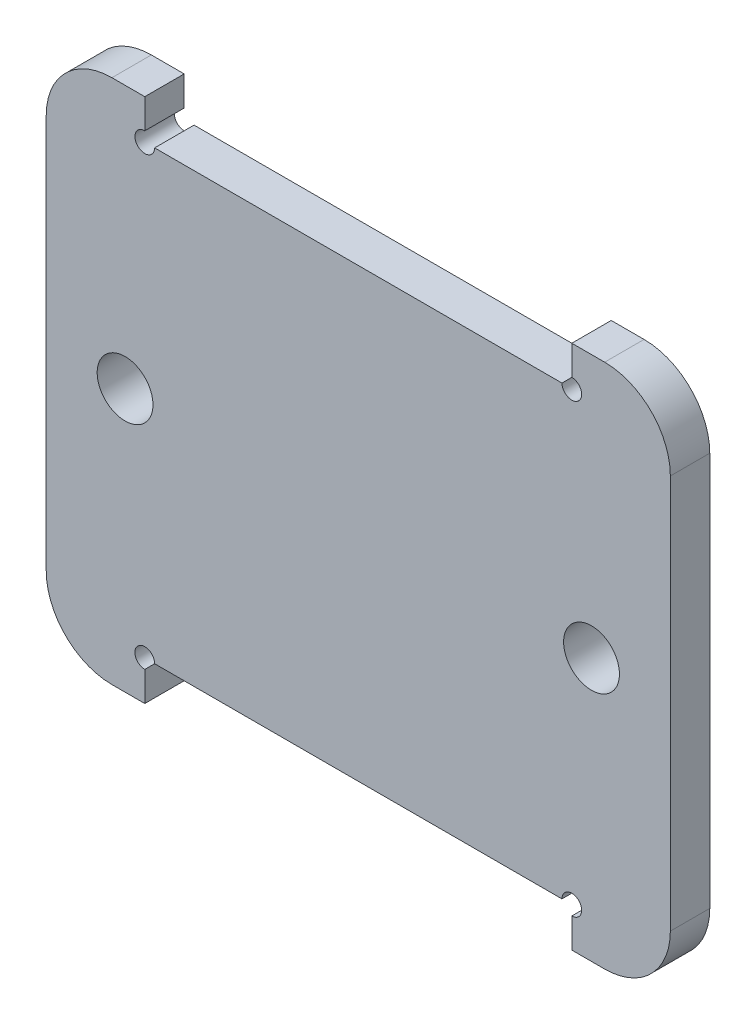
ISO-10303-21;
HEADER;
FILE_DESCRIPTION(('STEP AP214'),'2;1');
FILE_NAME('part.step','',(''),(''),'','','');
FILE_SCHEMA(('AUTOMOTIVE_DESIGN { 1 0 10303 214 1 1 1 1 }'));
ENDSEC;
DATA;
#1=APPLICATION_CONTEXT('core data for automotive mechanical design processes');
#2=APPLICATION_PROTOCOL_DEFINITION('international standard','automotive_design',2000,#1);
#3=PRODUCT_CONTEXT('',#1,'mechanical');
#4=PRODUCT('Part','Part','',(#3));
#5=PRODUCT_RELATED_PRODUCT_CATEGORY('part','',(#4));
#6=PRODUCT_DEFINITION_FORMATION('','',#4);
#7=PRODUCT_DEFINITION_CONTEXT('part definition',#1,'design');
#8=PRODUCT_DEFINITION('design','',#6,#7);
#9=PRODUCT_DEFINITION_SHAPE('','',#8);
#10=(LENGTH_UNIT() NAMED_UNIT(*) SI_UNIT(.MILLI.,.METRE.));
#11=(NAMED_UNIT(*) PLANE_ANGLE_UNIT() SI_UNIT($,.RADIAN.));
#12=(NAMED_UNIT(*) SI_UNIT($,.STERADIAN.) SOLID_ANGLE_UNIT());
#13=UNCERTAINTY_MEASURE_WITH_UNIT(LENGTH_MEASURE(1.E-05),#10,'distance_accuracy_value','');
#14=(GEOMETRIC_REPRESENTATION_CONTEXT(3) GLOBAL_UNCERTAINTY_ASSIGNED_CONTEXT((#13)) GLOBAL_UNIT_ASSIGNED_CONTEXT((#10,
#11,#12)) REPRESENTATION_CONTEXT('',''));
#15=CARTESIAN_POINT('',(0.,0.,0.));
#16=DIRECTION('',(0.,0.,1.));
#17=DIRECTION('',(1.,0.,0.));
#18=AXIS2_PLACEMENT_3D('',#15,#16,#17);
#19=CARTESIAN_POINT('',(-310.,90.0000000000003,6.));
#20=DIRECTION('',(0.,0.,-1.));
#21=DIRECTION('',(-1.,0.,0.));
#22=AXIS2_PLACEMENT_3D('',#19,#20,#21);
#23=PLANE('',#22);
#24=DIRECTION('',(1.,0.,0.));
#25=VECTOR('',#24,1.);
#26=CARTESIAN_POINT('',(-315.,26.0000000000003,6.));
#27=LINE('',#26,#25);
#28=CARTESIAN_POINT('',(-378.5,26.0000000000003,6.));
#29=VERTEX_POINT('',#28);
#30=CARTESIAN_POINT('',(-316.5,26.0000000000003,6.));
#31=VERTEX_POINT('',#30);
#32=EDGE_CURVE('E186',#29,#31,#27,.T.);
#33=ORIENTED_EDGE('',*,*,#32,.T.);
#34=CARTESIAN_POINT('',(-315.,26.0000000000003,6.));
#35=DIRECTION('',(0.,0.,1.));
#36=DIRECTION('',(-1.,0.,0.));
#37=AXIS2_PLACEMENT_3D('',#34,#35,#36);
#38=CIRCLE('',#37,1.50000000000002);
#39=CARTESIAN_POINT('',(-315.,24.5000000000003,6.));
#40=VERTEX_POINT('',#39);
#41=EDGE_CURVE('E169',#40,#31,#38,.T.);
#42=ORIENTED_EDGE('',*,*,#41,.F.);
#43=DIRECTION('',(0.,-1.,0.));
#44=VECTOR('',#43,1.);
#45=CARTESIAN_POINT('',(-315.,20.0000000000003,6.));
#46=LINE('',#45,#44);
#47=CARTESIAN_POINT('',(-315.,20.0000000000003,6.));
#48=VERTEX_POINT('',#47);
#49=EDGE_CURVE('E196',#40,#48,#46,.T.);
#50=ORIENTED_EDGE('',*,*,#49,.T.);
#51=DIRECTION('',(1.,0.,0.));
#52=VECTOR('',#51,1.);
#53=CARTESIAN_POINT('',(-310.,20.0000000000003,6.));
#54=LINE('',#53,#52);
#55=CARTESIAN_POINT('',(-310.,20.0000000000003,6.));
#56=VERTEX_POINT('',#55);
#57=EDGE_CURVE('E199',#48,#56,#54,.T.);
#58=ORIENTED_EDGE('',*,*,#57,.T.);
#59=CARTESIAN_POINT('',(-310.,30.0000000000002,6.));
#60=DIRECTION('',(0.,0.,1.));
#61=DIRECTION('',(-1.,0.,0.));
#62=AXIS2_PLACEMENT_3D('',#59,#60,#61);
#63=CIRCLE('',#62,10.);
#64=CARTESIAN_POINT('',(-300.,30.0000000000003,6.));
#65=VERTEX_POINT('',#64);
#66=EDGE_CURVE('E206',#56,#65,#63,.T.);
#67=ORIENTED_EDGE('',*,*,#66,.T.);
#68=DIRECTION('',(0.,1.,0.));
#69=VECTOR('',#68,1.);
#70=CARTESIAN_POINT('',(-300.,90.0000000000003,6.));
#71=LINE('',#70,#69);
#72=CARTESIAN_POINT('',(-300.,90.0000000000003,6.));
#73=VERTEX_POINT('',#72);
#74=EDGE_CURVE('E208',#65,#73,#71,.T.);
#75=ORIENTED_EDGE('',*,*,#74,.T.);
#76=CARTESIAN_POINT('',(-310.,90.0000000000003,6.));
#77=DIRECTION('',(0.,0.,1.));
#78=DIRECTION('',(-1.,0.,0.));
#79=AXIS2_PLACEMENT_3D('',#76,#77,#78);
#80=CIRCLE('',#79,10.);
#81=CARTESIAN_POINT('',(-310.,100.,6.));
#82=VERTEX_POINT('',#81);
#83=EDGE_CURVE('E210',#73,#82,#80,.T.);
#84=ORIENTED_EDGE('',*,*,#83,.T.);
#85=DIRECTION('',(-1.,0.,0.));
#86=VECTOR('',#85,1.);
#87=CARTESIAN_POINT('',(-315.,100.,6.));
#88=LINE('',#87,#86);
#89=CARTESIAN_POINT('',(-315.,100.,6.));
#90=VERTEX_POINT('',#89);
#91=EDGE_CURVE('E212',#82,#90,#88,.T.);
#92=ORIENTED_EDGE('',*,*,#91,.T.);
#93=DIRECTION('',(0.,-1.,0.));
#94=VECTOR('',#93,1.);
#95=CARTESIAN_POINT('',(-315.,94.0000000000003,6.));
#96=LINE('',#95,#94);
#97=CARTESIAN_POINT('',(-315.,95.5000000000003,6.));
#98=VERTEX_POINT('',#97);
#99=EDGE_CURVE('E250',#90,#98,#96,.T.);
#100=ORIENTED_EDGE('',*,*,#99,.T.);
#101=CARTESIAN_POINT('',(-315.,94.0000000000003,6.));
#102=DIRECTION('',(0.,0.,1.));
#103=DIRECTION('',(1.,0.,0.));
#104=AXIS2_PLACEMENT_3D('',#101,#102,#103);
#105=CIRCLE('',#104,1.50000000000002);
#106=CARTESIAN_POINT('',(-316.5,94.0000000000003,6.));
#107=VERTEX_POINT('',#106);
#108=EDGE_CURVE('E363',#107,#98,#105,.T.);
#109=ORIENTED_EDGE('',*,*,#108,.F.);
#110=DIRECTION('',(-1.,0.,0.));
#111=VECTOR('',#110,1.);
#112=CARTESIAN_POINT('',(-380.,94.0000000000003,6.));
#113=LINE('',#112,#111);
#114=CARTESIAN_POINT('',(-378.5,94.0000000000003,6.));
#115=VERTEX_POINT('',#114);
#116=EDGE_CURVE('E356',#107,#115,#113,.T.);
#117=ORIENTED_EDGE('',*,*,#116,.T.);
#118=CARTESIAN_POINT('',(-380.,94.0000000000003,6.));
#119=DIRECTION('',(0.,0.,1.));
#120=DIRECTION('',(-1.,0.,0.));
#121=AXIS2_PLACEMENT_3D('',#118,#119,#120);
#122=CIRCLE('',#121,1.50000000000002);
#123=CARTESIAN_POINT('',(-380.,95.5000000000003,6.));
#124=VERTEX_POINT('',#123);
#125=EDGE_CURVE('E358',#124,#115,#122,.T.);
#126=ORIENTED_EDGE('',*,*,#125,.F.);
#127=DIRECTION('',(0.,1.,0.));
#128=VECTOR('',#127,1.);
#129=CARTESIAN_POINT('',(-380.,94.0000000000003,6.));
#130=LINE('',#129,#128);
#131=CARTESIAN_POINT('',(-380.,100.,6.));
#132=VERTEX_POINT('',#131);
#133=EDGE_CURVE('E293',#124,#132,#130,.T.);
#134=ORIENTED_EDGE('',*,*,#133,.T.);
#135=DIRECTION('',(-1.,0.,0.));
#136=VECTOR('',#135,1.);
#137=CARTESIAN_POINT('',(-380.,100.,6.));
#138=LINE('',#137,#136);
#139=CARTESIAN_POINT('',(-385.,100.,6.));
#140=VERTEX_POINT('',#139);
#141=EDGE_CURVE('E313',#132,#140,#138,.T.);
#142=ORIENTED_EDGE('',*,*,#141,.T.);
#143=CARTESIAN_POINT('',(-385.,90.0000000000003,6.));
#144=DIRECTION('',(0.,0.,1.));
#145=DIRECTION('',(1.,0.,0.));
#146=AXIS2_PLACEMENT_3D('',#143,#144,#145);
#147=CIRCLE('',#146,10.);
#148=CARTESIAN_POINT('',(-395.,90.0000000000003,6.));
#149=VERTEX_POINT('',#148);
#150=EDGE_CURVE('E310',#140,#149,#147,.T.);
#151=ORIENTED_EDGE('',*,*,#150,.T.);
#152=DIRECTION('',(0.,-1.,0.));
#153=VECTOR('',#152,1.);
#154=CARTESIAN_POINT('',(-395.,90.0000000000003,6.));
#155=LINE('',#154,#153);
#156=CARTESIAN_POINT('',(-395.,30.0000000000002,6.));
#157=VERTEX_POINT('',#156);
#158=EDGE_CURVE('E312',#149,#157,#155,.T.);
#159=ORIENTED_EDGE('',*,*,#158,.T.);
#160=CARTESIAN_POINT('',(-385.,30.0000000000002,6.));
#161=DIRECTION('',(0.,0.,1.));
#162=DIRECTION('',(1.,0.,0.));
#163=AXIS2_PLACEMENT_3D('',#160,#161,#162);
#164=CIRCLE('',#163,10.);
#165=CARTESIAN_POINT('',(-385.,20.0000000000002,6.));
#166=VERTEX_POINT('',#165);
#167=EDGE_CURVE('E315',#157,#166,#164,.T.);
#168=ORIENTED_EDGE('',*,*,#167,.T.);
#169=DIRECTION('',(1.,0.,0.));
#170=VECTOR('',#169,1.);
#171=CARTESIAN_POINT('',(-385.,20.0000000000003,6.));
#172=LINE('',#171,#170);
#173=CARTESIAN_POINT('',(-380.,20.0000000000003,6.));
#174=VERTEX_POINT('',#173);
#175=EDGE_CURVE('E201',#166,#174,#172,.T.);
#176=ORIENTED_EDGE('',*,*,#175,.T.);
#177=DIRECTION('',(0.,1.,0.));
#178=VECTOR('',#177,1.);
#179=CARTESIAN_POINT('',(-380.,20.0000000000003,6.));
#180=LINE('',#179,#178);
#181=CARTESIAN_POINT('',(-380.,24.5000000000003,6.));
#182=VERTEX_POINT('',#181);
#183=EDGE_CURVE('E197',#174,#182,#180,.T.);
#184=ORIENTED_EDGE('',*,*,#183,.T.);
#185=CARTESIAN_POINT('',(-380.,26.0000000000003,6.));
#186=DIRECTION('',(0.,0.,1.));
#187=DIRECTION('',(1.,0.,0.));
#188=AXIS2_PLACEMENT_3D('',#185,#186,#187);
#189=CIRCLE('',#188,1.50000000000002);
#190=EDGE_CURVE('E195',#29,#182,#189,.T.);
#191=ORIENTED_EDGE('',*,*,#190,.F.);
#192=EDGE_LOOP('',(#33,#42,#50,#58,#67,#75,#84,#92,#100,#109,#117,#126,#134,#142,#151,#159,#168,
#176,#184,#191));
#193=FACE_BOUND('',#192,.T.);
#194=CARTESIAN_POINT('',(-312.,60.0000000000003,6.));
#195=DIRECTION('',(0.,0.,1.));
#196=DIRECTION('',(1.,0.,0.));
#197=AXIS2_PLACEMENT_3D('',#194,#195,#196);
#198=CIRCLE('',#197,4.24999999999995);
#199=CARTESIAN_POINT('',(-307.75,60.0000000000003,6.));
#200=VERTEX_POINT('',#199);
#201=EDGE_CURVE('E219',#200,#200,#198,.T.);
#202=ORIENTED_EDGE('',*,*,#201,.F.);
#203=EDGE_LOOP('',(#202));
#204=FACE_BOUND('',#203,.T.);
#205=CARTESIAN_POINT('',(-383.,60.0000000000003,6.));
#206=DIRECTION('',(0.,0.,1.));
#207=DIRECTION('',(-1.,0.,0.));
#208=AXIS2_PLACEMENT_3D('',#205,#206,#207);
#209=CIRCLE('',#208,4.24999999999995);
#210=CARTESIAN_POINT('',(-387.25,60.0000000000003,6.));
#211=VERTEX_POINT('',#210);
#212=EDGE_CURVE('E344',#211,#211,#209,.T.);
#213=ORIENTED_EDGE('',*,*,#212,.F.);
#214=EDGE_LOOP('',(#213));
#215=FACE_BOUND('',#214,.T.);
#216=ADVANCED_FACE('F34',(#193,#204,#215),#23,.F.);
#217=CARTESIAN_POINT('',(-310.,90.0000000000003,0.));
#218=DIRECTION('',(0.,0.,-1.));
#219=DIRECTION('',(-1.,0.,0.));
#220=AXIS2_PLACEMENT_3D('',#217,#218,#219);
#221=PLANE('',#220);
#222=CARTESIAN_POINT('',(-315.,26.0000000000003,0.));
#223=DIRECTION('',(0.,0.,1.));
#224=DIRECTION('',(-1.,0.,0.));
#225=AXIS2_PLACEMENT_3D('',#222,#223,#224);
#226=CIRCLE('',#225,1.50000000000002);
#227=CARTESIAN_POINT('',(-315.,24.5000000000003,0.));
#228=VERTEX_POINT('',#227);
#229=CARTESIAN_POINT('',(-316.5,26.0000000000003,0.));
#230=VERTEX_POINT('',#229);
#231=EDGE_CURVE('E179',#228,#230,#226,.T.);
#232=ORIENTED_EDGE('',*,*,#231,.T.);
#233=DIRECTION('',(1.,0.,0.));
#234=VECTOR('',#233,1.);
#235=CARTESIAN_POINT('',(-315.,26.0000000000003,0.));
#236=LINE('',#235,#234);
#237=CARTESIAN_POINT('',(-378.5,26.0000000000003,0.));
#238=VERTEX_POINT('',#237);
#239=EDGE_CURVE('E188',#238,#230,#236,.T.);
#240=ORIENTED_EDGE('',*,*,#239,.F.);
#241=CARTESIAN_POINT('',(-380.,26.0000000000003,0.));
#242=DIRECTION('',(0.,0.,1.));
#243=DIRECTION('',(1.,0.,0.));
#244=AXIS2_PLACEMENT_3D('',#241,#242,#243);
#245=CIRCLE('',#244,1.50000000000002);
#246=CARTESIAN_POINT('',(-380.,24.5000000000003,0.));
#247=VERTEX_POINT('',#246);
#248=EDGE_CURVE('E190',#238,#247,#245,.T.);
#249=ORIENTED_EDGE('',*,*,#248,.T.);
#250=DIRECTION('',(0.,1.,0.));
#251=VECTOR('',#250,1.);
#252=CARTESIAN_POINT('',(-380.,20.0000000000003,0.));
#253=LINE('',#252,#251);
#254=CARTESIAN_POINT('',(-380.,20.0000000000003,0.));
#255=VERTEX_POINT('',#254);
#256=EDGE_CURVE('E234',#255,#247,#253,.T.);
#257=ORIENTED_EDGE('',*,*,#256,.F.);
#258=DIRECTION('',(1.,0.,0.));
#259=VECTOR('',#258,1.);
#260=CARTESIAN_POINT('',(-385.,20.0000000000003,0.));
#261=LINE('',#260,#259);
#262=CARTESIAN_POINT('',(-385.,20.0000000000002,0.));
#263=VERTEX_POINT('',#262);
#264=EDGE_CURVE('E232',#263,#255,#261,.T.);
#265=ORIENTED_EDGE('',*,*,#264,.F.);
#266=CARTESIAN_POINT('',(-385.,30.0000000000002,0.));
#267=DIRECTION('',(0.,0.,1.));
#268=DIRECTION('',(1.,0.,0.));
#269=AXIS2_PLACEMENT_3D('',#266,#267,#268);
#270=CIRCLE('',#269,10.);
#271=CARTESIAN_POINT('',(-395.,30.0000000000002,0.));
#272=VERTEX_POINT('',#271);
#273=EDGE_CURVE('E230',#272,#263,#270,.T.);
#274=ORIENTED_EDGE('',*,*,#273,.F.);
#275=DIRECTION('',(0.,-1.,0.));
#276=VECTOR('',#275,1.);
#277=CARTESIAN_POINT('',(-395.,90.0000000000003,0.));
#278=LINE('',#277,#276);
#279=CARTESIAN_POINT('',(-395.,90.0000000000003,0.));
#280=VERTEX_POINT('',#279);
#281=EDGE_CURVE('E228',#280,#272,#278,.T.);
#282=ORIENTED_EDGE('',*,*,#281,.F.);
#283=CARTESIAN_POINT('',(-385.,90.0000000000003,0.));
#284=DIRECTION('',(0.,0.,1.));
#285=DIRECTION('',(1.,0.,0.));
#286=AXIS2_PLACEMENT_3D('',#283,#284,#285);
#287=CIRCLE('',#286,10.);
#288=CARTESIAN_POINT('',(-385.,100.,0.));
#289=VERTEX_POINT('',#288);
#290=EDGE_CURVE('E226',#289,#280,#287,.T.);
#291=ORIENTED_EDGE('',*,*,#290,.F.);
#292=DIRECTION('',(-1.,0.,0.));
#293=VECTOR('',#292,1.);
#294=CARTESIAN_POINT('',(-380.,100.,0.));
#295=LINE('',#294,#293);
#296=CARTESIAN_POINT('',(-380.,100.,0.));
#297=VERTEX_POINT('',#296);
#298=EDGE_CURVE('E224',#297,#289,#295,.T.);
#299=ORIENTED_EDGE('',*,*,#298,.F.);
#300=DIRECTION('',(0.,1.,0.));
#301=VECTOR('',#300,1.);
#302=CARTESIAN_POINT('',(-380.,94.0000000000003,0.));
#303=LINE('',#302,#301);
#304=CARTESIAN_POINT('',(-380.,95.5000000000003,0.));
#305=VERTEX_POINT('',#304);
#306=EDGE_CURVE('E222',#305,#297,#303,.T.);
#307=ORIENTED_EDGE('',*,*,#306,.F.);
#308=CARTESIAN_POINT('',(-380.,94.0000000000003,0.));
#309=DIRECTION('',(0.,0.,1.));
#310=DIRECTION('',(-1.,0.,0.));
#311=AXIS2_PLACEMENT_3D('',#308,#309,#310);
#312=CIRCLE('',#311,1.50000000000002);
#313=CARTESIAN_POINT('',(-378.5,94.0000000000003,0.));
#314=VERTEX_POINT('',#313);
#315=EDGE_CURVE('E56',#305,#314,#312,.T.);
#316=ORIENTED_EDGE('',*,*,#315,.T.);
#317=DIRECTION('',(-1.,0.,0.));
#318=VECTOR('',#317,1.);
#319=CARTESIAN_POINT('',(-380.,94.0000000000003,0.));
#320=LINE('',#319,#318);
#321=CARTESIAN_POINT('',(-316.5,94.0000000000003,0.));
#322=VERTEX_POINT('',#321);
#323=EDGE_CURVE('E218',#322,#314,#320,.T.);
#324=ORIENTED_EDGE('',*,*,#323,.F.);
#325=CARTESIAN_POINT('',(-315.,94.0000000000003,0.));
#326=DIRECTION('',(0.,0.,1.));
#327=DIRECTION('',(1.,0.,0.));
#328=AXIS2_PLACEMENT_3D('',#325,#326,#327);
#329=CIRCLE('',#328,1.50000000000002);
#330=CARTESIAN_POINT('',(-315.,95.5000000000003,0.));
#331=VERTEX_POINT('',#330);
#332=EDGE_CURVE('E49',#322,#331,#329,.T.);
#333=ORIENTED_EDGE('',*,*,#332,.T.);
#334=DIRECTION('',(0.,-1.,0.));
#335=VECTOR('',#334,1.);
#336=CARTESIAN_POINT('',(-315.,94.0000000000003,0.));
#337=LINE('',#336,#335);
#338=CARTESIAN_POINT('',(-315.,100.,0.));
#339=VERTEX_POINT('',#338);
#340=EDGE_CURVE('E215',#339,#331,#337,.T.);
#341=ORIENTED_EDGE('',*,*,#340,.F.);
#342=DIRECTION('',(-1.,0.,0.));
#343=VECTOR('',#342,1.);
#344=CARTESIAN_POINT('',(-315.,100.,0.));
#345=LINE('',#344,#343);
#346=CARTESIAN_POINT('',(-310.,100.,0.));
#347=VERTEX_POINT('',#346);
#348=EDGE_CURVE('E248',#347,#339,#345,.T.);
#349=ORIENTED_EDGE('',*,*,#348,.F.);
#350=CARTESIAN_POINT('',(-310.,90.0000000000003,0.));
#351=DIRECTION('',(0.,0.,1.));
#352=DIRECTION('',(-1.,0.,0.));
#353=AXIS2_PLACEMENT_3D('',#350,#351,#352);
#354=CIRCLE('',#353,10.);
#355=CARTESIAN_POINT('',(-300.,90.0000000000003,0.));
#356=VERTEX_POINT('',#355);
#357=EDGE_CURVE('E246',#356,#347,#354,.T.);
#358=ORIENTED_EDGE('',*,*,#357,.F.);
#359=DIRECTION('',(0.,1.,0.));
#360=VECTOR('',#359,1.);
#361=CARTESIAN_POINT('',(-300.,90.0000000000003,0.));
#362=LINE('',#361,#360);
#363=CARTESIAN_POINT('',(-300.,30.0000000000003,0.));
#364=VERTEX_POINT('',#363);
#365=EDGE_CURVE('E244',#364,#356,#362,.T.);
#366=ORIENTED_EDGE('',*,*,#365,.F.);
#367=CARTESIAN_POINT('',(-310.,30.0000000000002,0.));
#368=DIRECTION('',(0.,0.,1.));
#369=DIRECTION('',(-1.,0.,0.));
#370=AXIS2_PLACEMENT_3D('',#367,#368,#369);
#371=CIRCLE('',#370,10.);
#372=CARTESIAN_POINT('',(-310.,20.0000000000003,0.));
#373=VERTEX_POINT('',#372);
#374=EDGE_CURVE('E242',#373,#364,#371,.T.);
#375=ORIENTED_EDGE('',*,*,#374,.F.);
#376=DIRECTION('',(1.,0.,0.));
#377=VECTOR('',#376,1.);
#378=CARTESIAN_POINT('',(-310.,20.0000000000003,0.));
#379=LINE('',#378,#377);
#380=CARTESIAN_POINT('',(-315.,20.0000000000003,0.));
#381=VERTEX_POINT('',#380);
#382=EDGE_CURVE('E240',#381,#373,#379,.T.);
#383=ORIENTED_EDGE('',*,*,#382,.F.);
#384=DIRECTION('',(0.,-1.,0.));
#385=VECTOR('',#384,1.);
#386=CARTESIAN_POINT('',(-315.,20.0000000000003,0.));
#387=LINE('',#386,#385);
#388=EDGE_CURVE('E238',#228,#381,#387,.T.);
#389=ORIENTED_EDGE('',*,*,#388,.F.);
#390=EDGE_LOOP('',(#232,#240,#249,#257,#265,#274,#282,#291,#299,#307,#316,#324,#333,#341,#349,
#358,#366,#375,#383,#389));
#391=FACE_BOUND('',#390,.T.);
#392=CARTESIAN_POINT('',(-312.,60.0000000000003,0.));
#393=DIRECTION('',(0.,0.,1.));
#394=DIRECTION('',(1.,0.,0.));
#395=AXIS2_PLACEMENT_3D('',#392,#393,#394);
#396=CIRCLE('',#395,4.24999999999995);
#397=CARTESIAN_POINT('',(-307.75,60.0000000000003,0.));
#398=VERTEX_POINT('',#397);
#399=EDGE_CURVE('E347',#398,#398,#396,.T.);
#400=ORIENTED_EDGE('',*,*,#399,.T.);
#401=EDGE_LOOP('',(#400));
#402=FACE_BOUND('',#401,.T.);
#403=CARTESIAN_POINT('',(-383.,60.0000000000003,0.));
#404=DIRECTION('',(0.,0.,1.));
#405=DIRECTION('',(-1.,0.,0.));
#406=AXIS2_PLACEMENT_3D('',#403,#404,#405);
#407=CIRCLE('',#406,4.24999999999995);
#408=CARTESIAN_POINT('',(-387.25,60.0000000000003,0.));
#409=VERTEX_POINT('',#408);
#410=EDGE_CURVE('E343',#409,#409,#407,.T.);
#411=ORIENTED_EDGE('',*,*,#410,.T.);
#412=EDGE_LOOP('',(#411));
#413=FACE_BOUND('',#412,.T.);
#414=ADVANCED_FACE('F297',(#391,#402,#413),#221,.T.);
#415=CARTESIAN_POINT('',(-315.,94.0000000000003,6.));
#416=DIRECTION('',(1.,0.,0.));
#417=DIRECTION('',(0.,0.,-1.));
#418=AXIS2_PLACEMENT_3D('',#415,#416,#417);
#419=PLANE('',#418);
#420=ORIENTED_EDGE('',*,*,#340,.T.);
#421=DIRECTION('',(0.,0.,1.));
#422=VECTOR('',#421,1.);
#423=CARTESIAN_POINT('',(-315.,95.5000000000003,0.));
#424=LINE('',#423,#422);
#425=EDGE_CURVE('E337',#331,#98,#424,.T.);
#426=ORIENTED_EDGE('',*,*,#425,.T.);
#427=ORIENTED_EDGE('',*,*,#99,.F.);
#428=DIRECTION('',(0.,0.,-1.));
#429=VECTOR('',#428,1.);
#430=CARTESIAN_POINT('',(-315.,100.,6.));
#431=LINE('',#430,#429);
#432=EDGE_CURVE('E214',#90,#339,#431,.T.);
#433=ORIENTED_EDGE('',*,*,#432,.T.);
#434=EDGE_LOOP('',(#420,#426,#427,#433));
#435=FACE_BOUND('',#434,.T.);
#436=ADVANCED_FACE('F36',(#435),#419,.F.);
#437=CARTESIAN_POINT('',(-380.,94.0000000000003,6.));
#438=DIRECTION('',(0.,-1.,0.));
#439=DIRECTION('',(0.,0.,-1.));
#440=AXIS2_PLACEMENT_3D('',#437,#438,#439);
#441=PLANE('',#440);
#442=ORIENTED_EDGE('',*,*,#323,.T.);
#443=DIRECTION('',(0.,0.,1.));
#444=VECTOR('',#443,1.);
#445=CARTESIAN_POINT('',(-378.5,94.0000000000003,0.));
#446=LINE('',#445,#444);
#447=EDGE_CURVE('E334',#314,#115,#446,.T.);
#448=ORIENTED_EDGE('',*,*,#447,.T.);
#449=ORIENTED_EDGE('',*,*,#116,.F.);
#450=DIRECTION('',(0.,0.,1.));
#451=VECTOR('',#450,1.);
#452=CARTESIAN_POINT('',(-316.5,94.0000000000003,0.));
#453=LINE('',#452,#451);
#454=EDGE_CURVE('E11',#107,#322,#453,.F.);
#455=ORIENTED_EDGE('',*,*,#454,.T.);
#456=EDGE_LOOP('',(#442,#448,#449,#455));
#457=FACE_BOUND('',#456,.T.);
#458=ADVANCED_FACE('F382',(#457),#441,.F.);
#459=CARTESIAN_POINT('',(-380.,94.0000000000003,6.));
#460=DIRECTION('',(-1.,0.,0.));
#461=DIRECTION('',(0.,0.,1.));
#462=AXIS2_PLACEMENT_3D('',#459,#460,#461);
#463=PLANE('',#462);
#464=ORIENTED_EDGE('',*,*,#133,.F.);
#465=DIRECTION('',(0.,0.,1.));
#466=VECTOR('',#465,1.);
#467=CARTESIAN_POINT('',(-380.,95.5000000000003,0.));
#468=LINE('',#467,#466);
#469=EDGE_CURVE('E42',#124,#305,#468,.F.);
#470=ORIENTED_EDGE('',*,*,#469,.T.);
#471=ORIENTED_EDGE('',*,*,#306,.T.);
#472=DIRECTION('',(0.,0.,-1.));
#473=VECTOR('',#472,1.);
#474=CARTESIAN_POINT('',(-380.,100.,6.));
#475=LINE('',#474,#473);
#476=EDGE_CURVE('E283',#132,#297,#475,.T.);
#477=ORIENTED_EDGE('',*,*,#476,.F.);
#478=EDGE_LOOP('',(#464,#470,#471,#477));
#479=FACE_BOUND('',#478,.T.);
#480=ADVANCED_FACE('F291',(#479),#463,.F.);
#481=CARTESIAN_POINT('',(-380.,100.,6.));
#482=DIRECTION('',(0.,-1.,0.));
#483=DIRECTION('',(0.,0.,-1.));
#484=AXIS2_PLACEMENT_3D('',#481,#482,#483);
#485=PLANE('',#484);
#486=ORIENTED_EDGE('',*,*,#298,.T.);
#487=DIRECTION('',(0.,0.,-1.));
#488=VECTOR('',#487,1.);
#489=CARTESIAN_POINT('',(-385.,100.,6.));
#490=LINE('',#489,#488);
#491=EDGE_CURVE('E280',#140,#289,#490,.T.);
#492=ORIENTED_EDGE('',*,*,#491,.F.);
#493=ORIENTED_EDGE('',*,*,#141,.F.);
#494=ORIENTED_EDGE('',*,*,#476,.T.);
#495=EDGE_LOOP('',(#486,#492,#493,#494));
#496=FACE_BOUND('',#495,.T.);
#497=ADVANCED_FACE('F304',(#496),#485,.F.);
#498=CARTESIAN_POINT('',(-385.,90.0000000000003,6.));
#499=DIRECTION('',(0.,0.,-1.));
#500=DIRECTION('',(-1.,0.,0.));
#501=AXIS2_PLACEMENT_3D('',#498,#499,#500);
#502=CYLINDRICAL_SURFACE('',#501,10.);
#503=ORIENTED_EDGE('',*,*,#290,.T.);
#504=DIRECTION('',(0.,0.,-1.));
#505=VECTOR('',#504,1.);
#506=CARTESIAN_POINT('',(-395.,90.0000000000003,6.));
#507=LINE('',#506,#505);
#508=EDGE_CURVE('E277',#149,#280,#507,.T.);
#509=ORIENTED_EDGE('',*,*,#508,.F.);
#510=ORIENTED_EDGE('',*,*,#150,.F.);
#511=ORIENTED_EDGE('',*,*,#491,.T.);
#512=EDGE_LOOP('',(#503,#509,#510,#511));
#513=FACE_BOUND('',#512,.T.);
#514=ADVANCED_FACE('F308',(#513),#502,.T.);
#515=CARTESIAN_POINT('',(-395.,90.0000000000003,6.));
#516=DIRECTION('',(1.,0.,0.));
#517=DIRECTION('',(0.,0.,-1.));
#518=AXIS2_PLACEMENT_3D('',#515,#516,#517);
#519=PLANE('',#518);
#520=ORIENTED_EDGE('',*,*,#281,.T.);
#521=DIRECTION('',(0.,0.,-1.));
#522=VECTOR('',#521,1.);
#523=CARTESIAN_POINT('',(-395.,30.0000000000002,6.));
#524=LINE('',#523,#522);
#525=EDGE_CURVE('E274',#157,#272,#524,.T.);
#526=ORIENTED_EDGE('',*,*,#525,.F.);
#527=ORIENTED_EDGE('',*,*,#158,.F.);
#528=ORIENTED_EDGE('',*,*,#508,.T.);
#529=EDGE_LOOP('',(#520,#526,#527,#528));
#530=FACE_BOUND('',#529,.T.);
#531=ADVANCED_FACE('F435',(#530),#519,.F.);
#532=CARTESIAN_POINT('',(-385.,30.0000000000002,6.));
#533=DIRECTION('',(0.,0.,-1.));
#534=DIRECTION('',(-1.,0.,0.));
#535=AXIS2_PLACEMENT_3D('',#532,#533,#534);
#536=CYLINDRICAL_SURFACE('',#535,10.);
#537=ORIENTED_EDGE('',*,*,#273,.T.);
#538=DIRECTION('',(0.,0.,-1.));
#539=VECTOR('',#538,1.);
#540=CARTESIAN_POINT('',(-385.,20.0000000000002,6.));
#541=LINE('',#540,#539);
#542=EDGE_CURVE('E271',#166,#263,#541,.T.);
#543=ORIENTED_EDGE('',*,*,#542,.F.);
#544=ORIENTED_EDGE('',*,*,#167,.F.);
#545=ORIENTED_EDGE('',*,*,#525,.T.);
#546=EDGE_LOOP('',(#537,#543,#544,#545));
#547=FACE_BOUND('',#546,.T.);
#548=ADVANCED_FACE('F432',(#547),#536,.T.);
#549=CARTESIAN_POINT('',(-385.,20.0000000000003,6.));
#550=DIRECTION('',(0.,1.,0.));
#551=DIRECTION('',(0.,0.,1.));
#552=AXIS2_PLACEMENT_3D('',#549,#550,#551);
#553=PLANE('',#552);
#554=ORIENTED_EDGE('',*,*,#264,.T.);
#555=DIRECTION('',(0.,0.,-1.));
#556=VECTOR('',#555,1.);
#557=CARTESIAN_POINT('',(-380.,20.0000000000003,6.));
#558=LINE('',#557,#556);
#559=EDGE_CURVE('E268',#174,#255,#558,.T.);
#560=ORIENTED_EDGE('',*,*,#559,.F.);
#561=ORIENTED_EDGE('',*,*,#175,.F.);
#562=ORIENTED_EDGE('',*,*,#542,.T.);
#563=EDGE_LOOP('',(#554,#560,#561,#562));
#564=FACE_BOUND('',#563,.T.);
#565=ADVANCED_FACE('F326',(#564),#553,.F.);
#566=CARTESIAN_POINT('',(-380.,20.0000000000003,6.));
#567=DIRECTION('',(-1.,0.,0.));
#568=DIRECTION('',(0.,0.,1.));
#569=AXIS2_PLACEMENT_3D('',#566,#567,#568);
#570=PLANE('',#569);
#571=ORIENTED_EDGE('',*,*,#256,.T.);
#572=DIRECTION('',(0.,0.,1.));
#573=VECTOR('',#572,1.);
#574=CARTESIAN_POINT('',(-380.,24.5000000000003,0.));
#575=LINE('',#574,#573);
#576=EDGE_CURVE('E189',#247,#182,#575,.T.);
#577=ORIENTED_EDGE('',*,*,#576,.T.);
#578=ORIENTED_EDGE('',*,*,#183,.F.);
#579=ORIENTED_EDGE('',*,*,#559,.T.);
#580=EDGE_LOOP('',(#571,#577,#578,#579));
#581=FACE_BOUND('',#580,.T.);
#582=ADVANCED_FACE('F331',(#581),#570,.F.);
#583=CARTESIAN_POINT('',(-315.,26.0000000000003,6.));
#584=DIRECTION('',(0.,1.,0.));
#585=DIRECTION('',(-1.,0.,0.));
#586=AXIS2_PLACEMENT_3D('',#583,#584,#585);
#587=PLANE('',#586);
#588=ORIENTED_EDGE('',*,*,#239,.T.);
#589=DIRECTION('',(0.,0.,1.));
#590=VECTOR('',#589,1.);
#591=CARTESIAN_POINT('',(-316.5,26.0000000000003,0.));
#592=LINE('',#591,#590);
#593=EDGE_CURVE('E172',#230,#31,#592,.T.);
#594=ORIENTED_EDGE('',*,*,#593,.T.);
#595=ORIENTED_EDGE('',*,*,#32,.F.);
#596=DIRECTION('',(0.,0.,1.));
#597=VECTOR('',#596,1.);
#598=CARTESIAN_POINT('',(-378.5,26.0000000000003,0.));
#599=LINE('',#598,#597);
#600=EDGE_CURVE('E287',#29,#238,#599,.F.);
#601=ORIENTED_EDGE('',*,*,#600,.T.);
#602=EDGE_LOOP('',(#588,#594,#595,#601));
#603=FACE_BOUND('',#602,.T.);
#604=ADVANCED_FACE('F184',(#603),#587,.F.);
#605=CARTESIAN_POINT('',(-315.,20.0000000000003,6.));
#606=DIRECTION('',(1.,0.,0.));
#607=DIRECTION('',(0.,0.,-1.));
#608=AXIS2_PLACEMENT_3D('',#605,#606,#607);
#609=PLANE('',#608);
#610=ORIENTED_EDGE('',*,*,#49,.F.);
#611=DIRECTION('',(0.,0.,1.));
#612=VECTOR('',#611,1.);
#613=CARTESIAN_POINT('',(-315.,24.5000000000003,0.));
#614=LINE('',#613,#612);
#615=EDGE_CURVE('E175',#40,#228,#614,.F.);
#616=ORIENTED_EDGE('',*,*,#615,.T.);
#617=ORIENTED_EDGE('',*,*,#388,.T.);
#618=DIRECTION('',(0.,0.,-1.));
#619=VECTOR('',#618,1.);
#620=CARTESIAN_POINT('',(-315.,20.0000000000003,6.));
#621=LINE('',#620,#619);
#622=EDGE_CURVE('E265',#48,#381,#621,.T.);
#623=ORIENTED_EDGE('',*,*,#622,.F.);
#624=EDGE_LOOP('',(#610,#616,#617,#623));
#625=FACE_BOUND('',#624,.T.);
#626=ADVANCED_FACE('F421',(#625),#609,.F.);
#627=CARTESIAN_POINT('',(-310.,20.0000000000003,6.));
#628=DIRECTION('',(0.,1.,0.));
#629=DIRECTION('',(0.,0.,1.));
#630=AXIS2_PLACEMENT_3D('',#627,#628,#629);
#631=PLANE('',#630);
#632=ORIENTED_EDGE('',*,*,#382,.T.);
#633=DIRECTION('',(0.,0.,-1.));
#634=VECTOR('',#633,1.);
#635=CARTESIAN_POINT('',(-310.,20.0000000000003,6.));
#636=LINE('',#635,#634);
#637=EDGE_CURVE('E262',#56,#373,#636,.T.);
#638=ORIENTED_EDGE('',*,*,#637,.F.);
#639=ORIENTED_EDGE('',*,*,#57,.F.);
#640=ORIENTED_EDGE('',*,*,#622,.T.);
#641=EDGE_LOOP('',(#632,#638,#639,#640));
#642=FACE_BOUND('',#641,.T.);
#643=ADVANCED_FACE('F417',(#642),#631,.F.);
#644=CARTESIAN_POINT('',(-310.,30.0000000000002,6.));
#645=DIRECTION('',(0.,0.,-1.));
#646=DIRECTION('',(-1.,0.,0.));
#647=AXIS2_PLACEMENT_3D('',#644,#645,#646);
#648=CYLINDRICAL_SURFACE('',#647,10.);
#649=ORIENTED_EDGE('',*,*,#374,.T.);
#650=DIRECTION('',(0.,0.,-1.));
#651=VECTOR('',#650,1.);
#652=CARTESIAN_POINT('',(-300.,30.0000000000003,6.));
#653=LINE('',#652,#651);
#654=EDGE_CURVE('E259',#65,#364,#653,.T.);
#655=ORIENTED_EDGE('',*,*,#654,.F.);
#656=ORIENTED_EDGE('',*,*,#66,.F.);
#657=ORIENTED_EDGE('',*,*,#637,.T.);
#658=EDGE_LOOP('',(#649,#655,#656,#657));
#659=FACE_BOUND('',#658,.T.);
#660=ADVANCED_FACE('F413',(#659),#648,.T.);
#661=CARTESIAN_POINT('',(-300.,90.0000000000003,6.));
#662=DIRECTION('',(-1.,0.,0.));
#663=DIRECTION('',(0.,0.,1.));
#664=AXIS2_PLACEMENT_3D('',#661,#662,#663);
#665=PLANE('',#664);
#666=ORIENTED_EDGE('',*,*,#365,.T.);
#667=DIRECTION('',(0.,0.,-1.));
#668=VECTOR('',#667,1.);
#669=CARTESIAN_POINT('',(-300.,90.0000000000003,6.));
#670=LINE('',#669,#668);
#671=EDGE_CURVE('E256',#73,#356,#670,.T.);
#672=ORIENTED_EDGE('',*,*,#671,.F.);
#673=ORIENTED_EDGE('',*,*,#74,.F.);
#674=ORIENTED_EDGE('',*,*,#654,.T.);
#675=EDGE_LOOP('',(#666,#672,#673,#674));
#676=FACE_BOUND('',#675,.T.);
#677=ADVANCED_FACE('F409',(#676),#665,.F.);
#678=CARTESIAN_POINT('',(-310.,90.0000000000003,6.));
#679=DIRECTION('',(0.,0.,-1.));
#680=DIRECTION('',(-1.,0.,0.));
#681=AXIS2_PLACEMENT_3D('',#678,#679,#680);
#682=CYLINDRICAL_SURFACE('',#681,10.);
#683=ORIENTED_EDGE('',*,*,#357,.T.);
#684=DIRECTION('',(0.,0.,-1.));
#685=VECTOR('',#684,1.);
#686=CARTESIAN_POINT('',(-310.,100.,6.));
#687=LINE('',#686,#685);
#688=EDGE_CURVE('E253',#82,#347,#687,.T.);
#689=ORIENTED_EDGE('',*,*,#688,.F.);
#690=ORIENTED_EDGE('',*,*,#83,.F.);
#691=ORIENTED_EDGE('',*,*,#671,.T.);
#692=EDGE_LOOP('',(#683,#689,#690,#691));
#693=FACE_BOUND('',#692,.T.);
#694=ADVANCED_FACE('F406',(#693),#682,.T.);
#695=CARTESIAN_POINT('',(-315.,100.,6.));
#696=DIRECTION('',(0.,-1.,0.));
#697=DIRECTION('',(0.,0.,-1.));
#698=AXIS2_PLACEMENT_3D('',#695,#696,#697);
#699=PLANE('',#698);
#700=ORIENTED_EDGE('',*,*,#348,.T.);
#701=ORIENTED_EDGE('',*,*,#432,.F.);
#702=ORIENTED_EDGE('',*,*,#91,.F.);
#703=ORIENTED_EDGE('',*,*,#688,.T.);
#704=EDGE_LOOP('',(#700,#701,#702,#703));
#705=FACE_BOUND('',#704,.T.);
#706=ADVANCED_FACE('F378',(#705),#699,.F.);
#707=CARTESIAN_POINT('',(-312.,60.0000000000003,6.));
#708=DIRECTION('',(0.,0.,-1.));
#709=DIRECTION('',(-1.,0.,0.));
#710=AXIS2_PLACEMENT_3D('',#707,#708,#709);
#711=CYLINDRICAL_SURFACE('',#710,4.24999999999995);
#712=ORIENTED_EDGE('',*,*,#201,.T.);
#713=EDGE_LOOP('',(#712));
#714=FACE_BOUND('',#713,.T.);
#715=ORIENTED_EDGE('',*,*,#399,.F.);
#716=EDGE_LOOP('',(#715));
#717=FACE_BOUND('',#716,.T.);
#718=ADVANCED_FACE('F401',(#714,#717),#711,.F.);
#719=CARTESIAN_POINT('',(-383.,60.0000000000003,6.));
#720=DIRECTION('',(0.,0.,-1.));
#721=DIRECTION('',(-1.,0.,0.));
#722=AXIS2_PLACEMENT_3D('',#719,#720,#721);
#723=CYLINDRICAL_SURFACE('',#722,4.24999999999995);
#724=ORIENTED_EDGE('',*,*,#212,.T.);
#725=EDGE_LOOP('',(#724));
#726=FACE_BOUND('',#725,.T.);
#727=ORIENTED_EDGE('',*,*,#410,.F.);
#728=EDGE_LOOP('',(#727));
#729=FACE_BOUND('',#728,.T.);
#730=ADVANCED_FACE('F464',(#726,#729),#723,.F.);
#731=CARTESIAN_POINT('',(-315.,26.0000000000003,0.));
#732=DIRECTION('',(0.,0.,1.));
#733=DIRECTION('',(1.,0.,0.));
#734=AXIS2_PLACEMENT_3D('',#731,#732,#733);
#735=CYLINDRICAL_SURFACE('',#734,1.50000000000002);
#736=ORIENTED_EDGE('',*,*,#231,.F.);
#737=ORIENTED_EDGE('',*,*,#615,.F.);
#738=ORIENTED_EDGE('',*,*,#41,.T.);
#739=ORIENTED_EDGE('',*,*,#593,.F.);
#740=EDGE_LOOP('',(#736,#737,#738,#739));
#741=FACE_BOUND('',#740,.T.);
#742=ADVANCED_FACE('F171',(#741),#735,.F.);
#743=CARTESIAN_POINT('',(-380.,26.0000000000003,0.));
#744=DIRECTION('',(0.,0.,1.));
#745=DIRECTION('',(1.,0.,0.));
#746=AXIS2_PLACEMENT_3D('',#743,#744,#745);
#747=CYLINDRICAL_SURFACE('',#746,1.50000000000002);
#748=ORIENTED_EDGE('',*,*,#248,.F.);
#749=ORIENTED_EDGE('',*,*,#600,.F.);
#750=ORIENTED_EDGE('',*,*,#190,.T.);
#751=ORIENTED_EDGE('',*,*,#576,.F.);
#752=EDGE_LOOP('',(#748,#749,#750,#751));
#753=FACE_BOUND('',#752,.T.);
#754=ADVANCED_FACE('F385',(#753),#747,.F.);
#755=CARTESIAN_POINT('',(-380.,94.0000000000003,0.));
#756=DIRECTION('',(0.,0.,1.));
#757=DIRECTION('',(1.,0.,0.));
#758=AXIS2_PLACEMENT_3D('',#755,#756,#757);
#759=CYLINDRICAL_SURFACE('',#758,1.50000000000002);
#760=ORIENTED_EDGE('',*,*,#315,.F.);
#761=ORIENTED_EDGE('',*,*,#469,.F.);
#762=ORIENTED_EDGE('',*,*,#125,.T.);
#763=ORIENTED_EDGE('',*,*,#447,.F.);
#764=EDGE_LOOP('',(#760,#761,#762,#763));
#765=FACE_BOUND('',#764,.T.);
#766=ADVANCED_FACE('F383',(#765),#759,.F.);
#767=CARTESIAN_POINT('',(-315.,94.0000000000003,0.));
#768=DIRECTION('',(0.,0.,1.));
#769=DIRECTION('',(1.,0.,0.));
#770=AXIS2_PLACEMENT_3D('',#767,#768,#769);
#771=CYLINDRICAL_SURFACE('',#770,1.50000000000002);
#772=ORIENTED_EDGE('',*,*,#332,.F.);
#773=ORIENTED_EDGE('',*,*,#454,.F.);
#774=ORIENTED_EDGE('',*,*,#108,.T.);
#775=ORIENTED_EDGE('',*,*,#425,.F.);
#776=EDGE_LOOP('',(#772,#773,#774,#775));
#777=FACE_BOUND('',#776,.T.);
#778=ADVANCED_FACE('F369',(#777),#771,.F.);
#779=CLOSED_SHELL('',(#216,#414,#436,#458,#480,#497,#514,#531,#548,#565,#582,#604,#626,#643,
#660,#677,#694,#706,#718,#730,#742,#754,#766,#778));
#780=MANIFOLD_SOLID_BREP('B2',#779);
#781=ADVANCED_BREP_SHAPE_REPRESENTATION('',(#18,#780),#14);
#782=SHAPE_DEFINITION_REPRESENTATION(#9,#781);
ENDSEC;
END-ISO-10303-21;
